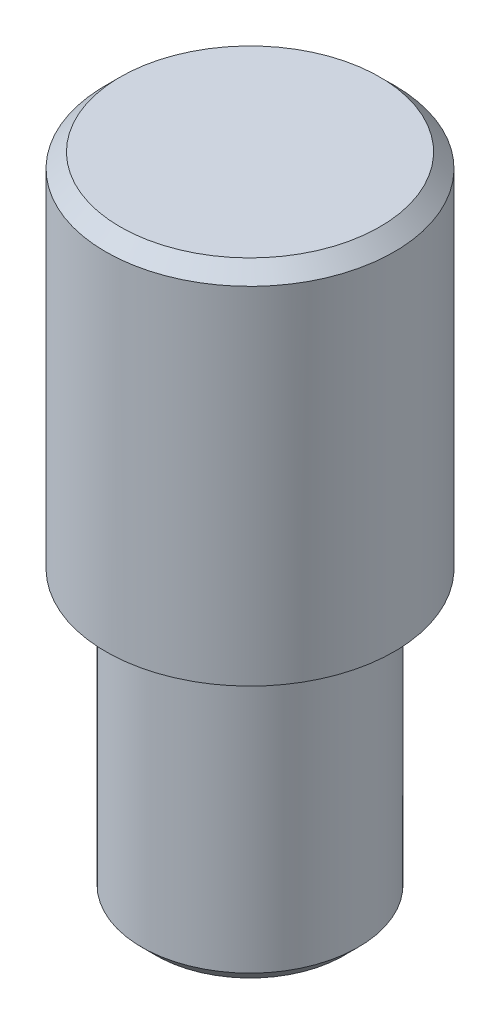
ISO-10303-21;
HEADER;
FILE_DESCRIPTION(('STEP AP214'),'2;1');
FILE_NAME('part.step','',(''),(''),'','','');
FILE_SCHEMA(('AUTOMOTIVE_DESIGN { 1 0 10303 214 1 1 1 1 }'));
ENDSEC;
DATA;
#1=APPLICATION_CONTEXT('core data for automotive mechanical design processes');
#2=APPLICATION_PROTOCOL_DEFINITION('international standard','automotive_design',2000,#1);
#3=PRODUCT_CONTEXT('',#1,'mechanical');
#4=PRODUCT('Part','Part','',(#3));
#5=PRODUCT_RELATED_PRODUCT_CATEGORY('part','',(#4));
#6=PRODUCT_DEFINITION_FORMATION('','',#4);
#7=PRODUCT_DEFINITION_CONTEXT('part definition',#1,'design');
#8=PRODUCT_DEFINITION('design','',#6,#7);
#9=PRODUCT_DEFINITION_SHAPE('','',#8);
#10=(LENGTH_UNIT() NAMED_UNIT(*) SI_UNIT(.MILLI.,.METRE.));
#11=(NAMED_UNIT(*) PLANE_ANGLE_UNIT() SI_UNIT($,.RADIAN.));
#12=(NAMED_UNIT(*) SI_UNIT($,.STERADIAN.) SOLID_ANGLE_UNIT());
#13=UNCERTAINTY_MEASURE_WITH_UNIT(LENGTH_MEASURE(1.E-05),#10,'distance_accuracy_value','');
#14=(GEOMETRIC_REPRESENTATION_CONTEXT(3) GLOBAL_UNCERTAINTY_ASSIGNED_CONTEXT((#13)) GLOBAL_UNIT_ASSIGNED_CONTEXT((#10,
#11,#12)) REPRESENTATION_CONTEXT('',''));
#15=CARTESIAN_POINT('',(0.,0.,0.));
#16=DIRECTION('',(0.,0.,1.));
#17=DIRECTION('',(1.,0.,0.));
#18=AXIS2_PLACEMENT_3D('',#15,#16,#17);
#19=CARTESIAN_POINT('',(0.,0.,0.));
#20=DIRECTION('',(0.,1.,0.));
#21=DIRECTION('',(0.,0.,1.));
#22=AXIS2_PLACEMENT_3D('',#19,#20,#21);
#23=PLANE('',#22);
#24=CARTESIAN_POINT('',(0.,0.,0.));
#25=DIRECTION('',(0.,1.,0.));
#26=DIRECTION('',(0.,0.,1.));
#27=AXIS2_PLACEMENT_3D('',#24,#25,#26);
#28=CIRCLE('',#27,8.99999999999999);
#29=CARTESIAN_POINT('',(0.,0.,8.99999999999999));
#30=VERTEX_POINT('',#29);
#31=EDGE_CURVE('E44',#30,#30,#28,.T.);
#32=ORIENTED_EDGE('',*,*,#31,.T.);
#33=EDGE_LOOP('',(#32));
#34=FACE_BOUND('',#33,.T.);
#35=ADVANCED_FACE('F33',(#34),#23,.T.);
#36=CARTESIAN_POINT('',(0.,-45.,0.));
#37=DIRECTION('',(0.,-1.,0.));
#38=DIRECTION('',(0.,0.,-1.));
#39=AXIS2_PLACEMENT_3D('',#36,#37,#38);
#40=CYLINDRICAL_SURFACE('',#39,10.);
#41=CARTESIAN_POINT('',(0.,-1.00000000000001,0.));
#42=DIRECTION('',(0.,1.,0.));
#43=DIRECTION('',(0.,0.,1.));
#44=AXIS2_PLACEMENT_3D('',#41,#42,#43);
#45=CIRCLE('',#44,10.);
#46=CARTESIAN_POINT('',(0.,-1.00000000000001,10.));
#47=VERTEX_POINT('',#46);
#48=EDGE_CURVE('E48',#47,#47,#45,.F.);
#49=ORIENTED_EDGE('',*,*,#48,.T.);
#50=EDGE_LOOP('',(#49));
#51=FACE_BOUND('',#50,.T.);
#52=CARTESIAN_POINT('',(0.,-25.,0.));
#53=DIRECTION('',(0.,-1.,0.));
#54=DIRECTION('',(0.,0.,-1.));
#55=AXIS2_PLACEMENT_3D('',#52,#53,#54);
#56=CIRCLE('',#55,10.);
#57=CARTESIAN_POINT('',(0.,-25.,-10.));
#58=VERTEX_POINT('',#57);
#59=EDGE_CURVE('E53',#58,#58,#56,.T.);
#60=ORIENTED_EDGE('',*,*,#59,.F.);
#61=EDGE_LOOP('',(#60));
#62=FACE_BOUND('',#61,.T.);
#63=ADVANCED_FACE('F64',(#51,#62),#40,.T.);
#64=CARTESIAN_POINT('',(10.,-25.,0.));
#65=DIRECTION('',(0.,-1.,0.));
#66=DIRECTION('',(0.,0.,-1.));
#67=AXIS2_PLACEMENT_3D('',#64,#65,#66);
#68=PLANE('',#67);
#69=ORIENTED_EDGE('',*,*,#59,.T.);
#70=EDGE_LOOP('',(#69));
#71=FACE_BOUND('',#70,.T.);
#72=CARTESIAN_POINT('',(0.,-25.,0.));
#73=DIRECTION('',(0.,-1.,0.));
#74=DIRECTION('',(0.,0.,-1.));
#75=AXIS2_PLACEMENT_3D('',#72,#73,#74);
#76=CIRCLE('',#75,7.5);
#77=CARTESIAN_POINT('',(0.,-25.,-7.5));
#78=VERTEX_POINT('',#77);
#79=EDGE_CURVE('E56',#78,#78,#76,.T.);
#80=ORIENTED_EDGE('',*,*,#79,.F.);
#81=EDGE_LOOP('',(#80));
#82=FACE_BOUND('',#81,.T.);
#83=ADVANCED_FACE('F62',(#71,#82),#68,.T.);
#84=CARTESIAN_POINT('',(0.,-45.,0.));
#85=DIRECTION('',(0.,-1.,0.));
#86=DIRECTION('',(0.,0.,-1.));
#87=AXIS2_PLACEMENT_3D('',#84,#85,#86);
#88=CYLINDRICAL_SURFACE('',#87,7.5);
#89=CARTESIAN_POINT('',(0.,-44.,0.));
#90=DIRECTION('',(0.,-1.,0.));
#91=DIRECTION('',(0.,0.,-1.));
#92=AXIS2_PLACEMENT_3D('',#89,#90,#91);
#93=CIRCLE('',#92,7.5);
#94=CARTESIAN_POINT('',(0.,-44.,-7.5));
#95=VERTEX_POINT('',#94);
#96=EDGE_CURVE('E10',#95,#95,#93,.F.);
#97=ORIENTED_EDGE('',*,*,#96,.T.);
#98=EDGE_LOOP('',(#97));
#99=FACE_BOUND('',#98,.T.);
#100=ORIENTED_EDGE('',*,*,#79,.T.);
#101=EDGE_LOOP('',(#100));
#102=FACE_BOUND('',#101,.T.);
#103=ADVANCED_FACE('F60',(#99,#102),#88,.T.);
#104=CARTESIAN_POINT('',(7.5,-45.,0.));
#105=DIRECTION('',(0.,-1.,0.));
#106=DIRECTION('',(0.,0.,-1.));
#107=AXIS2_PLACEMENT_3D('',#104,#105,#106);
#108=PLANE('',#107);
#109=CARTESIAN_POINT('',(0.,-45.,0.));
#110=DIRECTION('',(0.,-1.,0.));
#111=DIRECTION('',(0.,0.,-1.));
#112=AXIS2_PLACEMENT_3D('',#109,#110,#111);
#113=CIRCLE('',#112,6.5);
#114=CARTESIAN_POINT('',(0.,-45.,-6.5));
#115=VERTEX_POINT('',#114);
#116=EDGE_CURVE('E40',#115,#115,#113,.T.);
#117=ORIENTED_EDGE('',*,*,#116,.T.);
#118=EDGE_LOOP('',(#117));
#119=FACE_BOUND('',#118,.T.);
#120=ADVANCED_FACE('F71',(#119),#108,.T.);
#121=CARTESIAN_POINT('',(0.,-1.00000000000001,0.));
#122=DIRECTION('',(0.,-1.,0.));
#123=DIRECTION('',(0.,0.,-1.));
#124=AXIS2_PLACEMENT_3D('',#121,#122,#123);
#125=CONICAL_SURFACE('',#124,10.,0.78539816339745);
#126=ORIENTED_EDGE('',*,*,#31,.F.);
#127=EDGE_LOOP('',(#126));
#128=FACE_BOUND('',#127,.T.);
#129=ORIENTED_EDGE('',*,*,#48,.F.);
#130=EDGE_LOOP('',(#129));
#131=FACE_BOUND('',#130,.T.);
#132=ADVANCED_FACE('F80',(#128,#131),#125,.T.);
#133=CARTESIAN_POINT('',(0.,-45.,0.));
#134=DIRECTION('',(0.,1.,0.));
#135=DIRECTION('',(0.,0.,1.));
#136=AXIS2_PLACEMENT_3D('',#133,#134,#135);
#137=CONICAL_SURFACE('',#136,6.5,0.785398163397444);
#138=ORIENTED_EDGE('',*,*,#96,.F.);
#139=EDGE_LOOP('',(#138));
#140=FACE_BOUND('',#139,.T.);
#141=ORIENTED_EDGE('',*,*,#116,.F.);
#142=EDGE_LOOP('',(#141));
#143=FACE_BOUND('',#142,.T.);
#144=ADVANCED_FACE('F35',(#140,#143),#137,.T.);
#145=CLOSED_SHELL('',(#35,#63,#83,#103,#120,#132,#144));
#146=MANIFOLD_SOLID_BREP('B2',#145);
#147=ADVANCED_BREP_SHAPE_REPRESENTATION('',(#18,#146),#14);
#148=SHAPE_DEFINITION_REPRESENTATION(#9,#147);
ENDSEC;
END-ISO-10303-21;
